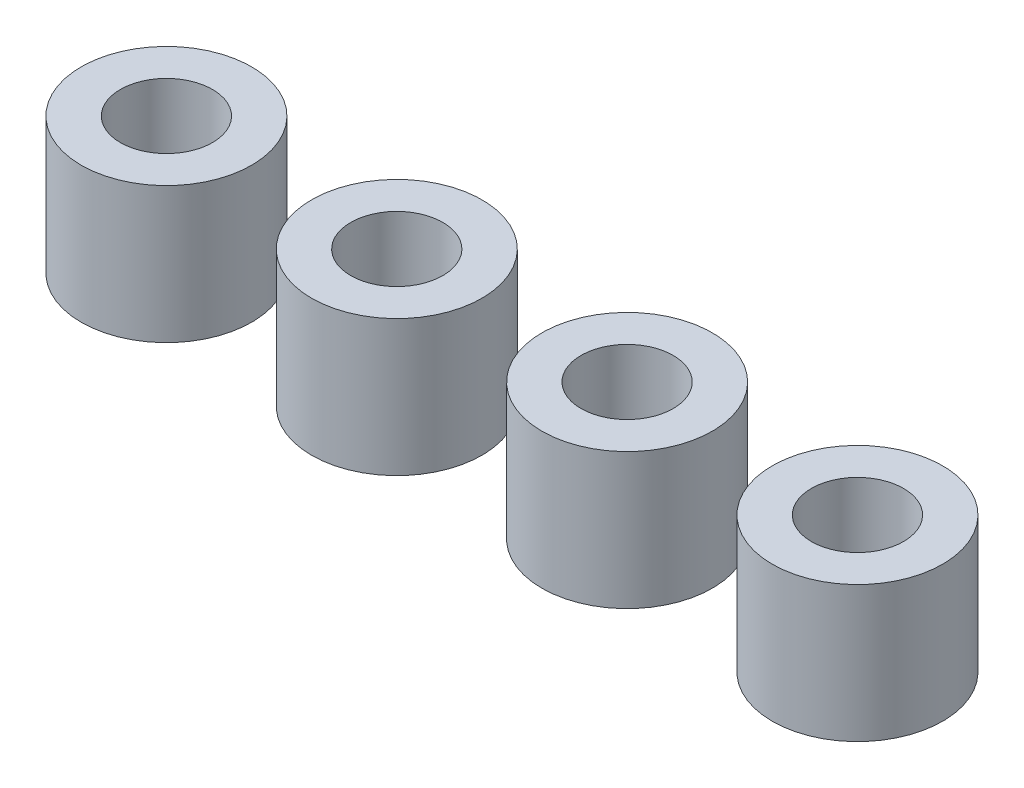
ISO-10303-21;
HEADER;
FILE_DESCRIPTION(('STEP AP214'),'2;1');
FILE_NAME('part.step','',(''),(''),'','','');
FILE_SCHEMA(('AUTOMOTIVE_DESIGN { 1 0 10303 214 1 1 1 1 }'));
ENDSEC;
DATA;
#1=APPLICATION_CONTEXT('core data for automotive mechanical design processes');
#2=APPLICATION_PROTOCOL_DEFINITION('international standard','automotive_design',2000,#1);
#3=PRODUCT_CONTEXT('',#1,'mechanical');
#4=PRODUCT('Part','Part','',(#3));
#5=PRODUCT_RELATED_PRODUCT_CATEGORY('part','',(#4));
#6=PRODUCT_DEFINITION_FORMATION('','',#4);
#7=PRODUCT_DEFINITION_CONTEXT('part definition',#1,'design');
#8=PRODUCT_DEFINITION('design','',#6,#7);
#9=PRODUCT_DEFINITION_SHAPE('','',#8);
#10=(LENGTH_UNIT() NAMED_UNIT(*) SI_UNIT(.MILLI.,.METRE.));
#11=(NAMED_UNIT(*) PLANE_ANGLE_UNIT() SI_UNIT($,.RADIAN.));
#12=(NAMED_UNIT(*) SI_UNIT($,.STERADIAN.) SOLID_ANGLE_UNIT());
#13=UNCERTAINTY_MEASURE_WITH_UNIT(LENGTH_MEASURE(1.E-05),#10,'distance_accuracy_value','');
#14=(GEOMETRIC_REPRESENTATION_CONTEXT(3) GLOBAL_UNCERTAINTY_ASSIGNED_CONTEXT((#13)) GLOBAL_UNIT_ASSIGNED_CONTEXT((#10,
#11,#12)) REPRESENTATION_CONTEXT('',''));
#15=CARTESIAN_POINT('',(0.,0.,0.));
#16=DIRECTION('',(0.,0.,1.));
#17=DIRECTION('',(1.,0.,0.));
#18=AXIS2_PLACEMENT_3D('',#15,#16,#17);
#19=CARTESIAN_POINT('',(4.80488980893453,1.5,-1.68145770871748));
#20=DIRECTION('',(0.,1.,0.));
#21=DIRECTION('',(0.,0.,1.));
#22=AXIS2_PLACEMENT_3D('',#19,#20,#21);
#23=PLANE('',#22);
#24=CARTESIAN_POINT('',(4.80488980893453,1.5,-1.68145770871748));
#25=DIRECTION('',(0.,1.,0.));
#26=DIRECTION('',(0.,0.,1.));
#27=AXIS2_PLACEMENT_3D('',#24,#25,#26);
#28=CIRCLE('',#27,0.940000000000001);
#29=CARTESIAN_POINT('',(4.80488980893453,1.5,-0.741457708717484));
#30=VERTEX_POINT('',#29);
#31=EDGE_CURVE('E11',#30,#30,#28,.T.);
#32=ORIENTED_EDGE('',*,*,#31,.T.);
#33=EDGE_LOOP('',(#32));
#34=FACE_BOUND('',#33,.T.);
#35=CARTESIAN_POINT('',(4.80488980893453,1.5,-1.68145770871748));
#36=DIRECTION('',(0.,1.,0.));
#37=DIRECTION('',(0.,0.,1.));
#38=AXIS2_PLACEMENT_3D('',#35,#36,#37);
#39=CIRCLE('',#38,0.508);
#40=CARTESIAN_POINT('',(4.80488980893453,1.5,-1.17345770871748));
#41=VERTEX_POINT('',#40);
#42=EDGE_CURVE('E58',#41,#41,#39,.T.);
#43=ORIENTED_EDGE('',*,*,#42,.F.);
#44=EDGE_LOOP('',(#43));
#45=FACE_BOUND('',#44,.T.);
#46=ADVANCED_FACE('F43',(#34,#45),#23,.T.);
#47=CARTESIAN_POINT('',(4.80488980893453,0.,-1.68145770871748));
#48=DIRECTION('',(0.,1.,0.));
#49=DIRECTION('',(0.,0.,1.));
#50=AXIS2_PLACEMENT_3D('',#47,#48,#49);
#51=PLANE('',#50);
#52=CARTESIAN_POINT('',(4.80488980893453,0.,-1.68145770871748));
#53=DIRECTION('',(0.,1.,0.));
#54=DIRECTION('',(0.,0.,1.));
#55=AXIS2_PLACEMENT_3D('',#52,#53,#54);
#56=CIRCLE('',#55,0.940000000000001);
#57=CARTESIAN_POINT('',(4.80488980893453,0.,-0.741457708717484));
#58=VERTEX_POINT('',#57);
#59=EDGE_CURVE('E47',#58,#58,#56,.T.);
#60=ORIENTED_EDGE('',*,*,#59,.F.);
#61=EDGE_LOOP('',(#60));
#62=FACE_BOUND('',#61,.T.);
#63=CARTESIAN_POINT('',(4.80488980893453,0.,-1.68145770871748));
#64=DIRECTION('',(0.,1.,0.));
#65=DIRECTION('',(0.,0.,1.));
#66=AXIS2_PLACEMENT_3D('',#63,#64,#65);
#67=CIRCLE('',#66,0.508);
#68=CARTESIAN_POINT('',(4.80488980893453,0.,-1.17345770871748));
#69=VERTEX_POINT('',#68);
#70=EDGE_CURVE('E60',#69,#69,#67,.T.);
#71=ORIENTED_EDGE('',*,*,#70,.T.);
#72=EDGE_LOOP('',(#71));
#73=FACE_BOUND('',#72,.T.);
#74=ADVANCED_FACE('F70',(#62,#73),#51,.F.);
#75=CARTESIAN_POINT('',(4.80488980893453,1.5,-1.68145770871748));
#76=DIRECTION('',(0.,-1.,0.));
#77=DIRECTION('',(0.,0.,-1.));
#78=AXIS2_PLACEMENT_3D('',#75,#76,#77);
#79=CYLINDRICAL_SURFACE('',#78,0.940000000000001);
#80=ORIENTED_EDGE('',*,*,#31,.F.);
#81=EDGE_LOOP('',(#80));
#82=FACE_BOUND('',#81,.T.);
#83=ORIENTED_EDGE('',*,*,#59,.T.);
#84=EDGE_LOOP('',(#83));
#85=FACE_BOUND('',#84,.T.);
#86=ADVANCED_FACE('F45',(#82,#85),#79,.T.);
#87=CARTESIAN_POINT('',(4.80488980893453,1.5,-1.68145770871748));
#88=DIRECTION('',(0.,-1.,0.));
#89=DIRECTION('',(0.,0.,-1.));
#90=AXIS2_PLACEMENT_3D('',#87,#88,#89);
#91=CYLINDRICAL_SURFACE('',#90,0.508);
#92=ORIENTED_EDGE('',*,*,#42,.T.);
#93=EDGE_LOOP('',(#92));
#94=FACE_BOUND('',#93,.T.);
#95=ORIENTED_EDGE('',*,*,#70,.F.);
#96=EDGE_LOOP('',(#95));
#97=FACE_BOUND('',#96,.T.);
#98=ADVANCED_FACE('F66',(#94,#97),#91,.F.);
#99=CLOSED_SHELL('',(#46,#74,#86,#98));
#100=MANIFOLD_SOLID_BREP('B2',#99);
#101=CARTESIAN_POINT('',(2.26488980893453,1.5,-1.68145770871748));
#102=DIRECTION('',(0.,1.,0.));
#103=DIRECTION('',(0.,0.,1.));
#104=AXIS2_PLACEMENT_3D('',#101,#102,#103);
#105=PLANE('',#104);
#106=CARTESIAN_POINT('',(2.26488980893453,1.5,-1.68145770871748));
#107=DIRECTION('',(0.,1.,0.));
#108=DIRECTION('',(0.,0.,1.));
#109=AXIS2_PLACEMENT_3D('',#106,#107,#108);
#110=CIRCLE('',#109,0.94);
#111=CARTESIAN_POINT('',(2.26488980893453,1.5,-0.741457708717484));
#112=VERTEX_POINT('',#111);
#113=EDGE_CURVE('E42',#112,#112,#110,.T.);
#114=ORIENTED_EDGE('',*,*,#113,.T.);
#115=EDGE_LOOP('',(#114));
#116=FACE_BOUND('',#115,.T.);
#117=CARTESIAN_POINT('',(2.26488980893453,1.5,-1.68145770871748));
#118=DIRECTION('',(0.,1.,0.));
#119=DIRECTION('',(0.,0.,1.));
#120=AXIS2_PLACEMENT_3D('',#117,#118,#119);
#121=CIRCLE('',#120,0.508);
#122=CARTESIAN_POINT('',(2.26488980893453,1.5,-1.17345770871748));
#123=VERTEX_POINT('',#122);
#124=EDGE_CURVE('E134',#123,#123,#121,.T.);
#125=ORIENTED_EDGE('',*,*,#124,.F.);
#126=EDGE_LOOP('',(#125));
#127=FACE_BOUND('',#126,.T.);
#128=ADVANCED_FACE('F120',(#116,#127),#105,.T.);
#129=CARTESIAN_POINT('',(2.26488980893453,0.,-1.68145770871748));
#130=DIRECTION('',(0.,1.,0.));
#131=DIRECTION('',(0.,0.,1.));
#132=AXIS2_PLACEMENT_3D('',#129,#130,#131);
#133=PLANE('',#132);
#134=CARTESIAN_POINT('',(2.26488980893453,0.,-1.68145770871748));
#135=DIRECTION('',(0.,1.,0.));
#136=DIRECTION('',(0.,0.,1.));
#137=AXIS2_PLACEMENT_3D('',#134,#135,#136);
#138=CIRCLE('',#137,0.94);
#139=CARTESIAN_POINT('',(2.26488980893453,0.,-0.741457708717484));
#140=VERTEX_POINT('',#139);
#141=EDGE_CURVE('E124',#140,#140,#138,.T.);
#142=ORIENTED_EDGE('',*,*,#141,.F.);
#143=EDGE_LOOP('',(#142));
#144=FACE_BOUND('',#143,.T.);
#145=CARTESIAN_POINT('',(2.26488980893453,0.,-1.68145770871748));
#146=DIRECTION('',(0.,1.,0.));
#147=DIRECTION('',(0.,0.,1.));
#148=AXIS2_PLACEMENT_3D('',#145,#146,#147);
#149=CIRCLE('',#148,0.508);
#150=CARTESIAN_POINT('',(2.26488980893453,0.,-1.17345770871748));
#151=VERTEX_POINT('',#150);
#152=EDGE_CURVE('E136',#151,#151,#149,.T.);
#153=ORIENTED_EDGE('',*,*,#152,.T.);
#154=EDGE_LOOP('',(#153));
#155=FACE_BOUND('',#154,.T.);
#156=ADVANCED_FACE('F147',(#144,#155),#133,.F.);
#157=CARTESIAN_POINT('',(2.26488980893453,1.5,-1.68145770871748));
#158=DIRECTION('',(0.,-1.,0.));
#159=DIRECTION('',(0.,0.,-1.));
#160=AXIS2_PLACEMENT_3D('',#157,#158,#159);
#161=CYLINDRICAL_SURFACE('',#160,0.94);
#162=ORIENTED_EDGE('',*,*,#113,.F.);
#163=EDGE_LOOP('',(#162));
#164=FACE_BOUND('',#163,.T.);
#165=ORIENTED_EDGE('',*,*,#141,.T.);
#166=EDGE_LOOP('',(#165));
#167=FACE_BOUND('',#166,.T.);
#168=ADVANCED_FACE('F122',(#164,#167),#161,.T.);
#169=CARTESIAN_POINT('',(2.26488980893453,1.5,-1.68145770871748));
#170=DIRECTION('',(0.,-1.,0.));
#171=DIRECTION('',(0.,0.,-1.));
#172=AXIS2_PLACEMENT_3D('',#169,#170,#171);
#173=CYLINDRICAL_SURFACE('',#172,0.508);
#174=ORIENTED_EDGE('',*,*,#124,.T.);
#175=EDGE_LOOP('',(#174));
#176=FACE_BOUND('',#175,.T.);
#177=ORIENTED_EDGE('',*,*,#152,.F.);
#178=EDGE_LOOP('',(#177));
#179=FACE_BOUND('',#178,.T.);
#180=ADVANCED_FACE('F143',(#176,#179),#173,.F.);
#181=CLOSED_SHELL('',(#128,#156,#168,#180));
#182=MANIFOLD_SOLID_BREP('B6',#181);
#183=CARTESIAN_POINT('',(-0.275110191065473,1.5,-1.68145770871748));
#184=DIRECTION('',(0.,1.,0.));
#185=DIRECTION('',(0.,0.,1.));
#186=AXIS2_PLACEMENT_3D('',#183,#184,#185);
#187=PLANE('',#186);
#188=CARTESIAN_POINT('',(-0.275110191065473,1.5,-1.68145770871748));
#189=DIRECTION('',(0.,1.,0.));
#190=DIRECTION('',(0.,0.,1.));
#191=AXIS2_PLACEMENT_3D('',#188,#189,#190);
#192=CIRCLE('',#191,0.94);
#193=CARTESIAN_POINT('',(-0.275110191065473,1.5,-0.741457708717485));
#194=VERTEX_POINT('',#193);
#195=EDGE_CURVE('E119',#194,#194,#192,.T.);
#196=ORIENTED_EDGE('',*,*,#195,.T.);
#197=EDGE_LOOP('',(#196));
#198=FACE_BOUND('',#197,.T.);
#199=CARTESIAN_POINT('',(-0.275110191065473,1.5,-1.68145770871748));
#200=DIRECTION('',(0.,1.,0.));
#201=DIRECTION('',(0.,0.,1.));
#202=AXIS2_PLACEMENT_3D('',#199,#200,#201);
#203=CIRCLE('',#202,0.508);
#204=CARTESIAN_POINT('',(-0.275110191065473,1.5,-1.17345770871748));
#205=VERTEX_POINT('',#204);
#206=EDGE_CURVE('E210',#205,#205,#203,.T.);
#207=ORIENTED_EDGE('',*,*,#206,.F.);
#208=EDGE_LOOP('',(#207));
#209=FACE_BOUND('',#208,.T.);
#210=ADVANCED_FACE('F196',(#198,#209),#187,.T.);
#211=CARTESIAN_POINT('',(-0.275110191065473,0.,-1.68145770871748));
#212=DIRECTION('',(0.,1.,0.));
#213=DIRECTION('',(0.,0.,1.));
#214=AXIS2_PLACEMENT_3D('',#211,#212,#213);
#215=PLANE('',#214);
#216=CARTESIAN_POINT('',(-0.275110191065473,0.,-1.68145770871748));
#217=DIRECTION('',(0.,1.,0.));
#218=DIRECTION('',(0.,0.,1.));
#219=AXIS2_PLACEMENT_3D('',#216,#217,#218);
#220=CIRCLE('',#219,0.94);
#221=CARTESIAN_POINT('',(-0.275110191065473,0.,-0.741457708717485));
#222=VERTEX_POINT('',#221);
#223=EDGE_CURVE('E200',#222,#222,#220,.T.);
#224=ORIENTED_EDGE('',*,*,#223,.F.);
#225=EDGE_LOOP('',(#224));
#226=FACE_BOUND('',#225,.T.);
#227=CARTESIAN_POINT('',(-0.275110191065473,0.,-1.68145770871748));
#228=DIRECTION('',(0.,1.,0.));
#229=DIRECTION('',(0.,0.,1.));
#230=AXIS2_PLACEMENT_3D('',#227,#228,#229);
#231=CIRCLE('',#230,0.508);
#232=CARTESIAN_POINT('',(-0.275110191065473,0.,-1.17345770871748));
#233=VERTEX_POINT('',#232);
#234=EDGE_CURVE('E212',#233,#233,#231,.T.);
#235=ORIENTED_EDGE('',*,*,#234,.T.);
#236=EDGE_LOOP('',(#235));
#237=FACE_BOUND('',#236,.T.);
#238=ADVANCED_FACE('F223',(#226,#237),#215,.F.);
#239=CARTESIAN_POINT('',(-0.275110191065473,1.5,-1.68145770871748));
#240=DIRECTION('',(0.,-1.,0.));
#241=DIRECTION('',(0.,0.,-1.));
#242=AXIS2_PLACEMENT_3D('',#239,#240,#241);
#243=CYLINDRICAL_SURFACE('',#242,0.94);
#244=ORIENTED_EDGE('',*,*,#195,.F.);
#245=EDGE_LOOP('',(#244));
#246=FACE_BOUND('',#245,.T.);
#247=ORIENTED_EDGE('',*,*,#223,.T.);
#248=EDGE_LOOP('',(#247));
#249=FACE_BOUND('',#248,.T.);
#250=ADVANCED_FACE('F198',(#246,#249),#243,.T.);
#251=CARTESIAN_POINT('',(-0.275110191065473,1.5,-1.68145770871748));
#252=DIRECTION('',(0.,-1.,0.));
#253=DIRECTION('',(0.,0.,-1.));
#254=AXIS2_PLACEMENT_3D('',#251,#252,#253);
#255=CYLINDRICAL_SURFACE('',#254,0.508);
#256=ORIENTED_EDGE('',*,*,#206,.T.);
#257=EDGE_LOOP('',(#256));
#258=FACE_BOUND('',#257,.T.);
#259=ORIENTED_EDGE('',*,*,#234,.F.);
#260=EDGE_LOOP('',(#259));
#261=FACE_BOUND('',#260,.T.);
#262=ADVANCED_FACE('F219',(#258,#261),#255,.F.);
#263=CLOSED_SHELL('',(#210,#238,#250,#262));
#264=MANIFOLD_SOLID_BREP('B37',#263);
#265=CARTESIAN_POINT('',(-2.81511019106547,1.5,-1.68145770871748));
#266=DIRECTION('',(0.,1.,0.));
#267=DIRECTION('',(0.,0.,1.));
#268=AXIS2_PLACEMENT_3D('',#265,#266,#267);
#269=PLANE('',#268);
#270=CARTESIAN_POINT('',(-2.81511019106547,1.5,-1.68145770871748));
#271=DIRECTION('',(0.,1.,0.));
#272=DIRECTION('',(0.,0.,1.));
#273=AXIS2_PLACEMENT_3D('',#270,#271,#272);
#274=CIRCLE('',#273,0.94);
#275=CARTESIAN_POINT('',(-2.81511019106547,1.5,-0.741457708717485));
#276=VERTEX_POINT('',#275);
#277=EDGE_CURVE('E195',#276,#276,#274,.T.);
#278=ORIENTED_EDGE('',*,*,#277,.T.);
#279=EDGE_LOOP('',(#278));
#280=FACE_BOUND('',#279,.T.);
#281=CARTESIAN_POINT('',(-2.81511019106547,1.5,-1.68145770871748));
#282=DIRECTION('',(0.,1.,0.));
#283=DIRECTION('',(0.,0.,1.));
#284=AXIS2_PLACEMENT_3D('',#281,#282,#283);
#285=CIRCLE('',#284,0.508);
#286=CARTESIAN_POINT('',(-2.81511019106547,1.5,-1.17345770871748));
#287=VERTEX_POINT('',#286);
#288=EDGE_CURVE('E278',#287,#287,#285,.T.);
#289=ORIENTED_EDGE('',*,*,#288,.F.);
#290=EDGE_LOOP('',(#289));
#291=FACE_BOUND('',#290,.T.);
#292=ADVANCED_FACE('F265',(#280,#291),#269,.T.);
#293=CARTESIAN_POINT('',(-2.81511019106547,0.,-1.68145770871748));
#294=DIRECTION('',(0.,1.,0.));
#295=DIRECTION('',(0.,0.,1.));
#296=AXIS2_PLACEMENT_3D('',#293,#294,#295);
#297=PLANE('',#296);
#298=CARTESIAN_POINT('',(-2.81511019106547,0.,-1.68145770871748));
#299=DIRECTION('',(0.,1.,0.));
#300=DIRECTION('',(0.,0.,1.));
#301=AXIS2_PLACEMENT_3D('',#298,#299,#300);
#302=CIRCLE('',#301,0.94);
#303=CARTESIAN_POINT('',(-2.81511019106547,0.,-0.741457708717485));
#304=VERTEX_POINT('',#303);
#305=EDGE_CURVE('E269',#304,#304,#302,.T.);
#306=ORIENTED_EDGE('',*,*,#305,.F.);
#307=EDGE_LOOP('',(#306));
#308=FACE_BOUND('',#307,.T.);
#309=CARTESIAN_POINT('',(-2.81511019106547,0.,-1.68145770871748));
#310=DIRECTION('',(0.,1.,0.));
#311=DIRECTION('',(0.,0.,1.));
#312=AXIS2_PLACEMENT_3D('',#309,#310,#311);
#313=CIRCLE('',#312,0.508);
#314=CARTESIAN_POINT('',(-2.81511019106547,0.,-1.17345770871748));
#315=VERTEX_POINT('',#314);
#316=EDGE_CURVE('E280',#315,#315,#313,.T.);
#317=ORIENTED_EDGE('',*,*,#316,.T.);
#318=EDGE_LOOP('',(#317));
#319=FACE_BOUND('',#318,.T.);
#320=ADVANCED_FACE('F292',(#308,#319),#297,.F.);
#321=CARTESIAN_POINT('',(-2.81511019106547,1.5,-1.68145770871748));
#322=DIRECTION('',(0.,-1.,0.));
#323=DIRECTION('',(0.,0.,-1.));
#324=AXIS2_PLACEMENT_3D('',#321,#322,#323);
#325=CYLINDRICAL_SURFACE('',#324,0.94);
#326=ORIENTED_EDGE('',*,*,#277,.F.);
#327=EDGE_LOOP('',(#326));
#328=FACE_BOUND('',#327,.T.);
#329=ORIENTED_EDGE('',*,*,#305,.T.);
#330=EDGE_LOOP('',(#329));
#331=FACE_BOUND('',#330,.T.);
#332=ADVANCED_FACE('F267',(#328,#331),#325,.T.);
#333=CARTESIAN_POINT('',(-2.81511019106547,1.5,-1.68145770871748));
#334=DIRECTION('',(0.,-1.,0.));
#335=DIRECTION('',(0.,0.,-1.));
#336=AXIS2_PLACEMENT_3D('',#333,#334,#335);
#337=CYLINDRICAL_SURFACE('',#336,0.508);
#338=ORIENTED_EDGE('',*,*,#288,.T.);
#339=EDGE_LOOP('',(#338));
#340=FACE_BOUND('',#339,.T.);
#341=ORIENTED_EDGE('',*,*,#316,.F.);
#342=EDGE_LOOP('',(#341));
#343=FACE_BOUND('',#342,.T.);
#344=ADVANCED_FACE('F288',(#340,#343),#337,.F.);
#345=CLOSED_SHELL('',(#292,#320,#332,#344));
#346=MANIFOLD_SOLID_BREP('B114',#345);
#347=ADVANCED_BREP_SHAPE_REPRESENTATION('',(#18,#100,#182,#264,#346),#14);
#348=SHAPE_DEFINITION_REPRESENTATION(#9,#347);
ENDSEC;
END-ISO-10303-21;
